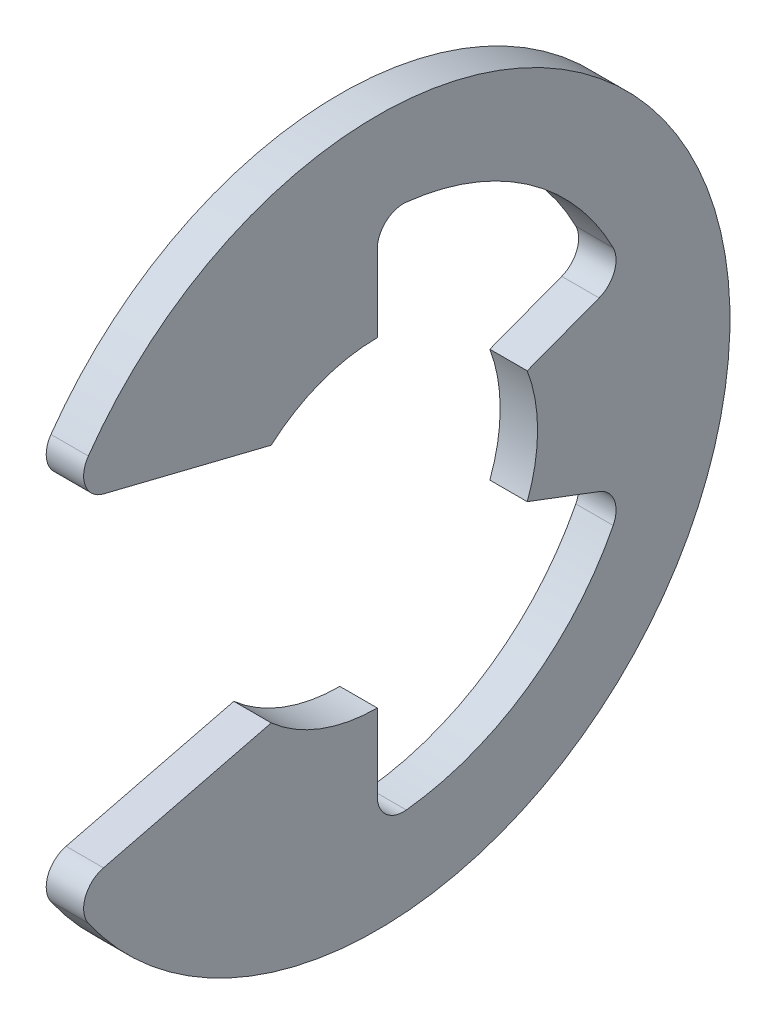
ISO-10303-21;
HEADER;
FILE_DESCRIPTION(('STEP AP214'),'2;1');
FILE_NAME('part.step','',(''),(''),'','','');
FILE_SCHEMA(('AUTOMOTIVE_DESIGN { 1 0 10303 214 1 1 1 1 }'));
ENDSEC;
DATA;
#1=APPLICATION_CONTEXT('core data for automotive mechanical design processes');
#2=APPLICATION_PROTOCOL_DEFINITION('international standard','automotive_design',2000,#1);
#3=PRODUCT_CONTEXT('',#1,'mechanical');
#4=PRODUCT('Part','Part','',(#3));
#5=PRODUCT_RELATED_PRODUCT_CATEGORY('part','',(#4));
#6=PRODUCT_DEFINITION_FORMATION('','',#4);
#7=PRODUCT_DEFINITION_CONTEXT('part definition',#1,'design');
#8=PRODUCT_DEFINITION('design','',#6,#7);
#9=PRODUCT_DEFINITION_SHAPE('','',#8);
#10=(LENGTH_UNIT() NAMED_UNIT(*) SI_UNIT(.MILLI.,.METRE.));
#11=(NAMED_UNIT(*) PLANE_ANGLE_UNIT() SI_UNIT($,.RADIAN.));
#12=(NAMED_UNIT(*) SI_UNIT($,.STERADIAN.) SOLID_ANGLE_UNIT());
#13=UNCERTAINTY_MEASURE_WITH_UNIT(LENGTH_MEASURE(1.E-05),#10,'distance_accuracy_value','');
#14=(GEOMETRIC_REPRESENTATION_CONTEXT(3) GLOBAL_UNCERTAINTY_ASSIGNED_CONTEXT((#13)) GLOBAL_UNIT_ASSIGNED_CONTEXT((#10,
#11,#12)) REPRESENTATION_CONTEXT('',''));
#15=CARTESIAN_POINT('',(0.,0.,0.));
#16=DIRECTION('',(0.,0.,1.));
#17=DIRECTION('',(1.,0.,0.));
#18=AXIS2_PLACEMENT_3D('',#15,#16,#17);
#19=CARTESIAN_POINT('',(0.4445,0.,0.));
#20=DIRECTION('',(-1.,0.,0.));
#21=DIRECTION('',(0.,0.,1.));
#22=AXIS2_PLACEMENT_3D('',#19,#20,#21);
#23=CYLINDRICAL_SURFACE('',#22,8.382);
#24=CARTESIAN_POINT('',(0.4445,0.,0.));
#25=DIRECTION('',(1.,0.,0.));
#26=DIRECTION('',(0.,0.,-1.));
#27=AXIS2_PLACEMENT_3D('',#24,#25,#26);
#28=CIRCLE('',#27,8.382);
#29=CARTESIAN_POINT('',(0.4445,-4.80802904314384,6.86591441253715));
#30=VERTEX_POINT('',#29);
#31=CARTESIAN_POINT('',(0.4445,4.80802904314383,6.86591441253715));
#32=VERTEX_POINT('',#31);
#33=EDGE_CURVE('E170',#30,#32,#28,.T.);
#34=ORIENTED_EDGE('',*,*,#33,.F.);
#35=DIRECTION('',(-1.,0.,0.));
#36=VECTOR('',#35,1.);
#37=CARTESIAN_POINT('',(0.4445,-4.80802904314384,6.86591441253715));
#38=LINE('',#37,#36);
#39=CARTESIAN_POINT('',(-0.4445,-4.80802904314384,6.86591441253715));
#40=VERTEX_POINT('',#39);
#41=EDGE_CURVE('E264',#30,#40,#38,.T.);
#42=ORIENTED_EDGE('',*,*,#41,.T.);
#43=CARTESIAN_POINT('',(-0.4445,0.,0.));
#44=DIRECTION('',(1.,0.,0.));
#45=DIRECTION('',(0.,0.,-1.));
#46=AXIS2_PLACEMENT_3D('',#43,#44,#45);
#47=CIRCLE('',#46,8.382);
#48=CARTESIAN_POINT('',(-0.4445,4.80802904314383,6.86591441253715));
#49=VERTEX_POINT('',#48);
#50=EDGE_CURVE('E208',#40,#49,#47,.T.);
#51=ORIENTED_EDGE('',*,*,#50,.T.);
#52=DIRECTION('',(-1.,0.,0.));
#53=VECTOR('',#52,1.);
#54=CARTESIAN_POINT('',(0.4445,4.80802904314383,6.86591441253715));
#55=LINE('',#54,#53);
#56=EDGE_CURVE('E262',#49,#32,#55,.F.);
#57=ORIENTED_EDGE('',*,*,#56,.T.);
#58=EDGE_LOOP('',(#34,#42,#51,#57));
#59=FACE_BOUND('',#58,.T.);
#60=ADVANCED_FACE('F32',(#59),#23,.T.);
#61=CARTESIAN_POINT('',(0.4445,4.05333224143882,7.33678551823021));
#62=DIRECTION('',(0.,0.970536829925373,-0.240952820606873));
#63=DIRECTION('',(0.,0.240952820606873,0.970536829925373));
#64=AXIS2_PLACEMENT_3D('',#61,#62,#63);
#65=PLANE('',#64);
#66=DIRECTION('',(0.,-0.240952820606873,-0.970536829925373));
#67=VECTOR('',#66,1.);
#68=CARTESIAN_POINT('',(0.4445,4.05333224143882,7.33678551823021));
#69=LINE('',#68,#67);
#70=CARTESIAN_POINT('',(0.4445,3.84710424189029,6.50611722217305));
#71=VERTEX_POINT('',#70);
#72=CARTESIAN_POINT('',(0.4445,2.8575,2.52007812378902));
#73=VERTEX_POINT('',#72);
#74=EDGE_CURVE('E156',#71,#73,#69,.T.);
#75=ORIENTED_EDGE('',*,*,#74,.F.);
#76=DIRECTION('',(-1.,0.,0.));
#77=VECTOR('',#76,1.);
#78=CARTESIAN_POINT('',(0.4445,3.84710424189029,6.50611722217305));
#79=LINE('',#78,#77);
#80=CARTESIAN_POINT('',(-0.4445,3.84710424189029,6.50611722217305));
#81=VERTEX_POINT('',#80);
#82=EDGE_CURVE('E276',#71,#81,#79,.T.);
#83=ORIENTED_EDGE('',*,*,#82,.T.);
#84=DIRECTION('',(0.,-0.240952820606873,-0.970536829925373));
#85=VECTOR('',#84,1.);
#86=CARTESIAN_POINT('',(-0.4445,4.05333224143882,7.33678551823021));
#87=LINE('',#86,#85);
#88=CARTESIAN_POINT('',(-0.4445,2.8575,2.52007812378902));
#89=VERTEX_POINT('',#88);
#90=EDGE_CURVE('E176',#81,#89,#87,.T.);
#91=ORIENTED_EDGE('',*,*,#90,.T.);
#92=DIRECTION('',(-1.,0.,0.));
#93=VECTOR('',#92,1.);
#94=CARTESIAN_POINT('',(0.4445,2.8575,2.52007812378902));
#95=LINE('',#94,#93);
#96=EDGE_CURVE('E173',#73,#89,#95,.T.);
#97=ORIENTED_EDGE('',*,*,#96,.F.);
#98=EDGE_LOOP('',(#75,#83,#91,#97));
#99=FACE_BOUND('',#98,.T.);
#100=ADVANCED_FACE('F174',(#99),#65,.F.);
#101=CARTESIAN_POINT('',(0.4445,0.,0.));
#102=DIRECTION('',(-1.,0.,0.));
#103=DIRECTION('',(0.,0.,1.));
#104=AXIS2_PLACEMENT_3D('',#101,#102,#103);
#105=CYLINDRICAL_SURFACE('',#104,3.81);
#106=CARTESIAN_POINT('',(-0.4445,0.,0.));
#107=DIRECTION('',(-1.,0.,0.));
#108=DIRECTION('',(0.,0.,1.));
#109=AXIS2_PLACEMENT_3D('',#106,#107,#108);
#110=CIRCLE('',#109,3.81);
#111=CARTESIAN_POINT('',(-0.4445,3.81,0.));
#112=VERTEX_POINT('',#111);
#113=EDGE_CURVE('E212',#89,#112,#110,.T.);
#114=ORIENTED_EDGE('',*,*,#113,.T.);
#115=DIRECTION('',(-1.,0.,0.));
#116=VECTOR('',#115,1.);
#117=CARTESIAN_POINT('',(0.4445,3.81,0.));
#118=LINE('',#117,#116);
#119=CARTESIAN_POINT('',(0.4445,3.81,0.));
#120=VERTEX_POINT('',#119);
#121=EDGE_CURVE('E180',#120,#112,#118,.T.);
#122=ORIENTED_EDGE('',*,*,#121,.F.);
#123=CARTESIAN_POINT('',(0.4445,0.,0.));
#124=DIRECTION('',(-1.,0.,0.));
#125=DIRECTION('',(0.,0.,1.));
#126=AXIS2_PLACEMENT_3D('',#123,#124,#125);
#127=CIRCLE('',#126,3.81);
#128=EDGE_CURVE('E162',#73,#120,#127,.T.);
#129=ORIENTED_EDGE('',*,*,#128,.F.);
#130=ORIENTED_EDGE('',*,*,#96,.T.);
#131=EDGE_LOOP('',(#114,#122,#129,#130));
#132=FACE_BOUND('',#131,.T.);
#133=ADVANCED_FACE('F182',(#132),#105,.F.);
#134=CARTESIAN_POINT('',(0.4445,3.81,0.));
#135=DIRECTION('',(0.,0.,1.));
#136=DIRECTION('',(0.,-1.,0.));
#137=AXIS2_PLACEMENT_3D('',#134,#135,#136);
#138=PLANE('',#137);
#139=DIRECTION('',(0.,1.,0.));
#140=VECTOR('',#139,1.);
#141=CARTESIAN_POINT('',(-0.4445,3.81,0.));
#142=LINE('',#141,#140);
#143=CARTESIAN_POINT('',(-0.4445,5.63609412254343,0.));
#144=VERTEX_POINT('',#143);
#145=EDGE_CURVE('E214',#112,#144,#142,.T.);
#146=ORIENTED_EDGE('',*,*,#145,.T.);
#147=DIRECTION('',(1.,0.,0.));
#148=VECTOR('',#147,1.);
#149=CARTESIAN_POINT('',(0.4445,5.63609412254343,0.));
#150=LINE('',#149,#148);
#151=CARTESIAN_POINT('',(0.4445,5.63609412254343,0.));
#152=VERTEX_POINT('',#151);
#153=EDGE_CURVE('E260',#144,#152,#150,.T.);
#154=ORIENTED_EDGE('',*,*,#153,.T.);
#155=DIRECTION('',(0.,1.,0.));
#156=VECTOR('',#155,1.);
#157=CARTESIAN_POINT('',(0.4445,3.81,0.));
#158=LINE('',#157,#156);
#159=EDGE_CURVE('E185',#120,#152,#158,.T.);
#160=ORIENTED_EDGE('',*,*,#159,.F.);
#161=ORIENTED_EDGE('',*,*,#121,.T.);
#162=EDGE_LOOP('',(#146,#154,#160,#161));
#163=FACE_BOUND('',#162,.T.);
#164=ADVANCED_FACE('F382',(#163),#138,.F.);
#165=CARTESIAN_POINT('',(0.4445,0.,0.));
#166=DIRECTION('',(-1.,0.,0.));
#167=DIRECTION('',(0.,0.,1.));
#168=AXIS2_PLACEMENT_3D('',#165,#166,#167);
#169=CYLINDRICAL_SURFACE('',#168,6.29264516129032);
#170=CARTESIAN_POINT('',(0.4445,0.,0.));
#171=DIRECTION('',(-1.,0.,0.));
#172=DIRECTION('',(0.,0.,-1.));
#173=AXIS2_PLACEMENT_3D('',#170,#171,#172);
#174=CIRCLE('',#173,6.29264516129032);
#175=CARTESIAN_POINT('',(0.4445,6.25463519415267,-0.690595188208944));
#176=VERTEX_POINT('',#175);
#177=CARTESIAN_POINT('',(0.4445,2.85734012662483,-5.60651322362572));
#178=VERTEX_POINT('',#177);
#179=EDGE_CURVE('E187',#176,#178,#174,.T.);
#180=ORIENTED_EDGE('',*,*,#179,.F.);
#181=DIRECTION('',(-1.,0.,0.));
#182=VECTOR('',#181,1.);
#183=CARTESIAN_POINT('',(0.4445,6.25463519415267,-0.690595188208944));
#184=LINE('',#183,#182);
#185=CARTESIAN_POINT('',(-0.4445,6.25463519415267,-0.690595188208944));
#186=VERTEX_POINT('',#185);
#187=EDGE_CURVE('E257',#176,#186,#184,.T.);
#188=ORIENTED_EDGE('',*,*,#187,.T.);
#189=CARTESIAN_POINT('',(-0.4445,0.,0.));
#190=DIRECTION('',(-1.,0.,0.));
#191=DIRECTION('',(0.,0.,-1.));
#192=AXIS2_PLACEMENT_3D('',#189,#190,#191);
#193=CIRCLE('',#192,6.29264516129032);
#194=CARTESIAN_POINT('',(-0.4445,2.85734012662483,-5.60651322362572));
#195=VERTEX_POINT('',#194);
#196=EDGE_CURVE('E217',#186,#195,#193,.T.);
#197=ORIENTED_EDGE('',*,*,#196,.T.);
#198=DIRECTION('',(-1.,0.,0.));
#199=VECTOR('',#198,1.);
#200=CARTESIAN_POINT('',(0.4445,2.85734012662483,-5.60651322362572));
#201=LINE('',#200,#199);
#202=EDGE_CURVE('E255',#195,#178,#201,.F.);
#203=ORIENTED_EDGE('',*,*,#202,.T.);
#204=EDGE_LOOP('',(#180,#188,#197,#203));
#205=FACE_BOUND('',#204,.T.);
#206=ADVANCED_FACE('F304',(#205),#169,.F.);
#207=CARTESIAN_POINT('',(0.4445,1.34703841816037,-3.56392866090218));
#208=DIRECTION('',(0.,-0.935414346693485,-0.353553390593274));
#209=DIRECTION('',(0.,0.353553390593274,-0.935414346693485));
#210=AXIS2_PLACEMENT_3D('',#207,#208,#209);
#211=PLANE('',#210);
#212=DIRECTION('',(0.,-0.353553390593274,0.935414346693485));
#213=VECTOR('',#212,1.);
#214=CARTESIAN_POINT('',(0.4445,1.34703841816037,-3.56392866090218));
#215=LINE('',#214,#213);
#216=CARTESIAN_POINT('',(0.4445,1.99266018672805,-5.27208330154195));
#217=VERTEX_POINT('',#216);
#218=CARTESIAN_POINT('',(0.4445,1.34703841816037,-3.56392866090218));
#219=VERTEX_POINT('',#218);
#220=EDGE_CURVE('E192',#217,#219,#215,.T.);
#221=ORIENTED_EDGE('',*,*,#220,.F.);
#222=DIRECTION('',(1.,0.,0.));
#223=VECTOR('',#222,1.);
#224=CARTESIAN_POINT('',(-0.4445,1.99266018672805,-5.27208330154195));
#225=LINE('',#224,#223);
#226=CARTESIAN_POINT('',(-0.4445,1.99266018672805,-5.27208330154195));
#227=VERTEX_POINT('',#226);
#228=EDGE_CURVE('E279',#217,#227,#225,.F.);
#229=ORIENTED_EDGE('',*,*,#228,.T.);
#230=DIRECTION('',(0.,-0.353553390593274,0.935414346693485));
#231=VECTOR('',#230,1.);
#232=CARTESIAN_POINT('',(-0.4445,1.34703841816037,-3.56392866090218));
#233=LINE('',#232,#231);
#234=CARTESIAN_POINT('',(-0.4445,1.34703841816037,-3.56392866090218));
#235=VERTEX_POINT('',#234);
#236=EDGE_CURVE('E220',#227,#235,#233,.T.);
#237=ORIENTED_EDGE('',*,*,#236,.T.);
#238=DIRECTION('',(-1.,0.,0.));
#239=VECTOR('',#238,1.);
#240=CARTESIAN_POINT('',(0.4445,1.34703841816037,-3.56392866090218));
#241=LINE('',#240,#239);
#242=EDGE_CURVE('E244',#219,#235,#241,.T.);
#243=ORIENTED_EDGE('',*,*,#242,.F.);
#244=EDGE_LOOP('',(#221,#229,#237,#243));
#245=FACE_BOUND('',#244,.T.);
#246=ADVANCED_FACE('F307',(#245),#211,.F.);
#247=CARTESIAN_POINT('',(0.4445,0.,0.));
#248=DIRECTION('',(-1.,0.,0.));
#249=DIRECTION('',(0.,0.,1.));
#250=AXIS2_PLACEMENT_3D('',#247,#248,#249);
#251=CYLINDRICAL_SURFACE('',#250,3.81);
#252=CARTESIAN_POINT('',(-0.4445,0.,0.));
#253=DIRECTION('',(-1.,0.,0.));
#254=DIRECTION('',(0.,0.,1.));
#255=AXIS2_PLACEMENT_3D('',#252,#253,#254);
#256=CIRCLE('',#255,3.81);
#257=CARTESIAN_POINT('',(-0.4445,-1.34703841816037,-3.56392866090218));
#258=VERTEX_POINT('',#257);
#259=EDGE_CURVE('E222',#235,#258,#256,.T.);
#260=ORIENTED_EDGE('',*,*,#259,.T.);
#261=DIRECTION('',(-1.,0.,0.));
#262=VECTOR('',#261,1.);
#263=CARTESIAN_POINT('',(0.4445,-1.34703841816037,-3.56392866090218));
#264=LINE('',#263,#262);
#265=CARTESIAN_POINT('',(0.4445,-1.34703841816037,-3.56392866090218));
#266=VERTEX_POINT('',#265);
#267=EDGE_CURVE('E241',#266,#258,#264,.T.);
#268=ORIENTED_EDGE('',*,*,#267,.F.);
#269=CARTESIAN_POINT('',(0.4445,0.,0.));
#270=DIRECTION('',(-1.,0.,0.));
#271=DIRECTION('',(0.,0.,1.));
#272=AXIS2_PLACEMENT_3D('',#269,#270,#271);
#273=CIRCLE('',#272,3.81);
#274=EDGE_CURVE('E194',#219,#266,#273,.T.);
#275=ORIENTED_EDGE('',*,*,#274,.F.);
#276=ORIENTED_EDGE('',*,*,#242,.T.);
#277=EDGE_LOOP('',(#260,#268,#275,#276));
#278=FACE_BOUND('',#277,.T.);
#279=ADVANCED_FACE('F313',(#278),#251,.F.);
#280=CARTESIAN_POINT('',(0.4445,-1.34703841816037,-3.56392866090218));
#281=DIRECTION('',(0.,0.935414346693485,-0.353553390593274));
#282=DIRECTION('',(0.,0.353553390593274,0.935414346693485));
#283=AXIS2_PLACEMENT_3D('',#280,#281,#282);
#284=PLANE('',#283);
#285=DIRECTION('',(0.,-0.353553390593274,-0.935414346693485));
#286=VECTOR('',#285,1.);
#287=CARTESIAN_POINT('',(-0.4445,-1.34703841816037,-3.56392866090218));
#288=LINE('',#287,#286);
#289=CARTESIAN_POINT('',(-0.4445,-1.99266018672805,-5.27208330154195));
#290=VERTEX_POINT('',#289);
#291=EDGE_CURVE('E224',#258,#290,#288,.T.);
#292=ORIENTED_EDGE('',*,*,#291,.T.);
#293=DIRECTION('',(1.,0.,0.));
#294=VECTOR('',#293,1.);
#295=CARTESIAN_POINT('',(0.4445,-1.99266018672805,-5.27208330154195));
#296=LINE('',#295,#294);
#297=CARTESIAN_POINT('',(0.4445,-1.99266018672805,-5.27208330154195));
#298=VERTEX_POINT('',#297);
#299=EDGE_CURVE('E47',#290,#298,#296,.T.);
#300=ORIENTED_EDGE('',*,*,#299,.T.);
#301=DIRECTION('',(0.,-0.353553390593274,-0.935414346693485));
#302=VECTOR('',#301,1.);
#303=CARTESIAN_POINT('',(0.4445,-1.34703841816037,-3.56392866090218));
#304=LINE('',#303,#302);
#305=EDGE_CURVE('E196',#266,#298,#304,.T.);
#306=ORIENTED_EDGE('',*,*,#305,.F.);
#307=ORIENTED_EDGE('',*,*,#267,.T.);
#308=EDGE_LOOP('',(#292,#300,#306,#307));
#309=FACE_BOUND('',#308,.T.);
#310=ADVANCED_FACE('F315',(#309),#284,.F.);
#311=CARTESIAN_POINT('',(0.4445,0.,0.));
#312=DIRECTION('',(-1.,0.,0.));
#313=DIRECTION('',(0.,0.,1.));
#314=AXIS2_PLACEMENT_3D('',#311,#312,#313);
#315=CYLINDRICAL_SURFACE('',#314,6.29264516129032);
#316=CARTESIAN_POINT('',(-0.4445,0.,0.));
#317=DIRECTION('',(-1.,0.,0.));
#318=DIRECTION('',(0.,0.,-1.));
#319=AXIS2_PLACEMENT_3D('',#316,#317,#318);
#320=CIRCLE('',#319,6.29264516129032);
#321=CARTESIAN_POINT('',(-0.4445,-2.85734012662483,-5.60651322362573));
#322=VERTEX_POINT('',#321);
#323=CARTESIAN_POINT('',(-0.4445,-6.25463519415267,-0.690595188208945));
#324=VERTEX_POINT('',#323);
#325=EDGE_CURVE('E226',#322,#324,#320,.T.);
#326=ORIENTED_EDGE('',*,*,#325,.T.);
#327=DIRECTION('',(-1.,0.,0.));
#328=VECTOR('',#327,1.);
#329=CARTESIAN_POINT('',(0.4445,-6.25463519415267,-0.690595188208945));
#330=LINE('',#329,#328);
#331=CARTESIAN_POINT('',(0.4445,-6.25463519415267,-0.690595188208945));
#332=VERTEX_POINT('',#331);
#333=EDGE_CURVE('E253',#324,#332,#330,.F.);
#334=ORIENTED_EDGE('',*,*,#333,.T.);
#335=CARTESIAN_POINT('',(0.4445,0.,0.));
#336=DIRECTION('',(-1.,0.,0.));
#337=DIRECTION('',(0.,0.,-1.));
#338=AXIS2_PLACEMENT_3D('',#335,#336,#337);
#339=CIRCLE('',#338,6.29264516129032);
#340=CARTESIAN_POINT('',(0.4445,-2.85734012662483,-5.60651322362573));
#341=VERTEX_POINT('',#340);
#342=EDGE_CURVE('E198',#341,#332,#339,.T.);
#343=ORIENTED_EDGE('',*,*,#342,.F.);
#344=DIRECTION('',(-1.,0.,0.));
#345=VECTOR('',#344,1.);
#346=CARTESIAN_POINT('',(0.4445,-2.85734012662483,-5.60651322362573));
#347=LINE('',#346,#345);
#348=EDGE_CURVE('E250',#341,#322,#347,.T.);
#349=ORIENTED_EDGE('',*,*,#348,.T.);
#350=EDGE_LOOP('',(#326,#334,#343,#349));
#351=FACE_BOUND('',#350,.T.);
#352=ADVANCED_FACE('F317',(#351),#315,.F.);
#353=CARTESIAN_POINT('',(0.4445,-3.81,0.));
#354=DIRECTION('',(0.,0.,1.));
#355=DIRECTION('',(0.,-1.,0.));
#356=AXIS2_PLACEMENT_3D('',#353,#354,#355);
#357=PLANE('',#356);
#358=DIRECTION('',(0.,1.,0.));
#359=VECTOR('',#358,1.);
#360=CARTESIAN_POINT('',(0.4445,-3.81,0.));
#361=LINE('',#360,#359);
#362=CARTESIAN_POINT('',(0.4445,-5.63609412254343,0.));
#363=VERTEX_POINT('',#362);
#364=CARTESIAN_POINT('',(0.4445,-3.81,0.));
#365=VERTEX_POINT('',#364);
#366=EDGE_CURVE('E201',#363,#365,#361,.T.);
#367=ORIENTED_EDGE('',*,*,#366,.F.);
#368=DIRECTION('',(1.,0.,0.));
#369=VECTOR('',#368,1.);
#370=CARTESIAN_POINT('',(-0.4445,-5.63609412254343,0.));
#371=LINE('',#370,#369);
#372=CARTESIAN_POINT('',(-0.4445,-5.63609412254343,0.));
#373=VERTEX_POINT('',#372);
#374=EDGE_CURVE('E179',#363,#373,#371,.F.);
#375=ORIENTED_EDGE('',*,*,#374,.T.);
#376=DIRECTION('',(0.,1.,0.));
#377=VECTOR('',#376,1.);
#378=CARTESIAN_POINT('',(-0.4445,-3.81,0.));
#379=LINE('',#378,#377);
#380=CARTESIAN_POINT('',(-0.4445,-3.81,0.));
#381=VERTEX_POINT('',#380);
#382=EDGE_CURVE('E229',#373,#381,#379,.T.);
#383=ORIENTED_EDGE('',*,*,#382,.T.);
#384=DIRECTION('',(-1.,0.,0.));
#385=VECTOR('',#384,1.);
#386=CARTESIAN_POINT('',(0.4445,-3.81,0.));
#387=LINE('',#386,#385);
#388=EDGE_CURVE('E238',#365,#381,#387,.T.);
#389=ORIENTED_EDGE('',*,*,#388,.F.);
#390=EDGE_LOOP('',(#367,#375,#383,#389));
#391=FACE_BOUND('',#390,.T.);
#392=ADVANCED_FACE('F323',(#391),#357,.F.);
#393=CARTESIAN_POINT('',(0.4445,0.,0.));
#394=DIRECTION('',(-1.,0.,0.));
#395=DIRECTION('',(0.,0.,1.));
#396=AXIS2_PLACEMENT_3D('',#393,#394,#395);
#397=CYLINDRICAL_SURFACE('',#396,3.81);
#398=CARTESIAN_POINT('',(-0.4445,0.,0.));
#399=DIRECTION('',(-1.,0.,0.));
#400=DIRECTION('',(0.,0.,-1.));
#401=AXIS2_PLACEMENT_3D('',#398,#399,#400);
#402=CIRCLE('',#401,3.81);
#403=CARTESIAN_POINT('',(-0.4445,-2.8575,2.52007812378902));
#404=VERTEX_POINT('',#403);
#405=EDGE_CURVE('E231',#381,#404,#402,.T.);
#406=ORIENTED_EDGE('',*,*,#405,.T.);
#407=DIRECTION('',(-1.,0.,0.));
#408=VECTOR('',#407,1.);
#409=CARTESIAN_POINT('',(0.4445,-2.8575,2.52007812378902));
#410=LINE('',#409,#408);
#411=CARTESIAN_POINT('',(0.4445,-2.8575,2.52007812378902));
#412=VERTEX_POINT('',#411);
#413=EDGE_CURVE('E207',#412,#404,#410,.T.);
#414=ORIENTED_EDGE('',*,*,#413,.F.);
#415=CARTESIAN_POINT('',(0.4445,0.,0.));
#416=DIRECTION('',(-1.,0.,0.));
#417=DIRECTION('',(0.,0.,-1.));
#418=AXIS2_PLACEMENT_3D('',#415,#416,#417);
#419=CIRCLE('',#418,3.81);
#420=EDGE_CURVE('E203',#365,#412,#419,.T.);
#421=ORIENTED_EDGE('',*,*,#420,.F.);
#422=ORIENTED_EDGE('',*,*,#388,.T.);
#423=EDGE_LOOP('',(#406,#414,#421,#422));
#424=FACE_BOUND('',#423,.T.);
#425=ADVANCED_FACE('F372',(#424),#397,.F.);
#426=CARTESIAN_POINT('',(0.4445,-4.05333224143882,7.33678551823021));
#427=DIRECTION('',(0.,-0.970536829925373,-0.240952820606873));
#428=DIRECTION('',(0.,0.240952820606873,-0.970536829925373));
#429=AXIS2_PLACEMENT_3D('',#426,#427,#428);
#430=PLANE('',#429);
#431=DIRECTION('',(0.,-0.240952820606873,0.970536829925373));
#432=VECTOR('',#431,1.);
#433=CARTESIAN_POINT('',(-0.4445,-4.05333224143882,7.33678551823021));
#434=LINE('',#433,#432);
#435=CARTESIAN_POINT('',(-0.4445,-3.84710424189029,6.50611722217305));
#436=VERTEX_POINT('',#435);
#437=EDGE_CURVE('E233',#404,#436,#434,.T.);
#438=ORIENTED_EDGE('',*,*,#437,.T.);
#439=DIRECTION('',(-1.,0.,0.));
#440=VECTOR('',#439,1.);
#441=CARTESIAN_POINT('',(0.4445,-3.84710424189029,6.50611722217305));
#442=LINE('',#441,#440);
#443=CARTESIAN_POINT('',(0.4445,-3.84710424189029,6.50611722217305));
#444=VERTEX_POINT('',#443);
#445=EDGE_CURVE('E271',#436,#444,#442,.F.);
#446=ORIENTED_EDGE('',*,*,#445,.T.);
#447=DIRECTION('',(0.,-0.240952820606873,0.970536829925373));
#448=VECTOR('',#447,1.);
#449=CARTESIAN_POINT('',(0.4445,-4.05333224143882,7.33678551823021));
#450=LINE('',#449,#448);
#451=EDGE_CURVE('E205',#412,#444,#450,.T.);
#452=ORIENTED_EDGE('',*,*,#451,.F.);
#453=ORIENTED_EDGE('',*,*,#413,.T.);
#454=EDGE_LOOP('',(#438,#446,#452,#453));
#455=FACE_BOUND('',#454,.T.);
#456=ADVANCED_FACE('F414',(#455),#430,.F.);
#457=CARTESIAN_POINT('',(0.4445,0.,0.));
#458=DIRECTION('',(1.,0.,0.));
#459=DIRECTION('',(0.,0.,-1.));
#460=AXIS2_PLACEMENT_3D('',#457,#458,#459);
#461=PLANE('',#460);
#462=ORIENTED_EDGE('',*,*,#451,.T.);
#463=CARTESIAN_POINT('',(0.4445,-4.45106931115285,6.35617228190939));
#464=DIRECTION('',(1.,0.,0.));
#465=DIRECTION('',(0.,0.,-1.));
#466=AXIS2_PLACEMENT_3D('',#463,#464,#465);
#467=CIRCLE('',#466,0.6223);
#468=EDGE_CURVE('E274',#444,#30,#467,.T.);
#469=ORIENTED_EDGE('',*,*,#468,.T.);
#470=ORIENTED_EDGE('',*,*,#33,.T.);
#471=CARTESIAN_POINT('',(0.4445,4.45106931115285,6.35617228190939));
#472=DIRECTION('',(1.,0.,0.));
#473=DIRECTION('',(0.,0.,-1.));
#474=AXIS2_PLACEMENT_3D('',#471,#472,#473);
#475=CIRCLE('',#474,0.6223);
#476=EDGE_CURVE('E166',#32,#71,#475,.T.);
#477=ORIENTED_EDGE('',*,*,#476,.T.);
#478=ORIENTED_EDGE('',*,*,#74,.T.);
#479=ORIENTED_EDGE('',*,*,#128,.T.);
#480=ORIENTED_EDGE('',*,*,#159,.T.);
#481=CARTESIAN_POINT('',(0.4445,5.63609412254343,-0.622299999999999));
#482=DIRECTION('',(1.,0.,0.));
#483=DIRECTION('',(0.,0.,-1.));
#484=AXIS2_PLACEMENT_3D('',#481,#482,#483);
#485=CIRCLE('',#484,0.6223);
#486=EDGE_CURVE('E288',#152,#176,#485,.F.);
#487=ORIENTED_EDGE('',*,*,#486,.T.);
#488=ORIENTED_EDGE('',*,*,#179,.T.);
#489=CARTESIAN_POINT('',(0.4445,2.57476853467541,-5.05206702657576));
#490=DIRECTION('',(1.,0.,0.));
#491=DIRECTION('',(0.,0.,-1.));
#492=AXIS2_PLACEMENT_3D('',#489,#490,#491);
#493=CIRCLE('',#492,0.6223);
#494=EDGE_CURVE('E11',#178,#217,#493,.F.);
#495=ORIENTED_EDGE('',*,*,#494,.T.);
#496=ORIENTED_EDGE('',*,*,#220,.T.);
#497=ORIENTED_EDGE('',*,*,#274,.T.);
#498=ORIENTED_EDGE('',*,*,#305,.T.);
#499=CARTESIAN_POINT('',(0.4445,-2.57476853467541,-5.05206702657576));
#500=DIRECTION('',(1.,0.,0.));
#501=DIRECTION('',(0.,0.,-1.));
#502=AXIS2_PLACEMENT_3D('',#499,#500,#501);
#503=CIRCLE('',#502,0.6223);
#504=EDGE_CURVE('E292',#298,#341,#503,.F.);
#505=ORIENTED_EDGE('',*,*,#504,.T.);
#506=ORIENTED_EDGE('',*,*,#342,.T.);
#507=CARTESIAN_POINT('',(0.4445,-5.63609412254343,-0.622300000000001));
#508=DIRECTION('',(1.,0.,0.));
#509=DIRECTION('',(0.,0.,-1.));
#510=AXIS2_PLACEMENT_3D('',#507,#508,#509);
#511=CIRCLE('',#510,0.6223);
#512=EDGE_CURVE('E284',#332,#363,#511,.F.);
#513=ORIENTED_EDGE('',*,*,#512,.T.);
#514=ORIENTED_EDGE('',*,*,#366,.T.);
#515=ORIENTED_EDGE('',*,*,#420,.T.);
#516=EDGE_LOOP('',(#462,#469,#470,#477,#478,#479,#480,#487,#488,#495,#496,#497,#498,#505,#506,
#513,#514,#515));
#517=FACE_BOUND('',#516,.T.);
#518=ADVANCED_FACE('F159',(#517),#461,.T.);
#519=CARTESIAN_POINT('',(-0.4445,0.,0.));
#520=DIRECTION('',(1.,0.,0.));
#521=DIRECTION('',(0.,0.,-1.));
#522=AXIS2_PLACEMENT_3D('',#519,#520,#521);
#523=PLANE('',#522);
#524=ORIENTED_EDGE('',*,*,#50,.F.);
#525=CARTESIAN_POINT('',(-0.4445,-4.45106931115285,6.35617228190939));
#526=DIRECTION('',(1.,0.,0.));
#527=DIRECTION('',(0.,0.,-1.));
#528=AXIS2_PLACEMENT_3D('',#525,#526,#527);
#529=CIRCLE('',#528,0.6223);
#530=EDGE_CURVE('E269',#40,#436,#529,.F.);
#531=ORIENTED_EDGE('',*,*,#530,.T.);
#532=ORIENTED_EDGE('',*,*,#437,.F.);
#533=ORIENTED_EDGE('',*,*,#405,.F.);
#534=ORIENTED_EDGE('',*,*,#382,.F.);
#535=CARTESIAN_POINT('',(-0.4445,-5.63609412254343,-0.622300000000001));
#536=DIRECTION('',(1.,0.,0.));
#537=DIRECTION('',(0.,0.,-1.));
#538=AXIS2_PLACEMENT_3D('',#535,#536,#537);
#539=CIRCLE('',#538,0.6223);
#540=EDGE_CURVE('E282',#373,#324,#539,.T.);
#541=ORIENTED_EDGE('',*,*,#540,.T.);
#542=ORIENTED_EDGE('',*,*,#325,.F.);
#543=CARTESIAN_POINT('',(-0.4445,-2.57476853467541,-5.05206702657576));
#544=DIRECTION('',(1.,0.,0.));
#545=DIRECTION('',(0.,0.,-1.));
#546=AXIS2_PLACEMENT_3D('',#543,#544,#545);
#547=CIRCLE('',#546,0.6223);
#548=EDGE_CURVE('E290',#322,#290,#547,.T.);
#549=ORIENTED_EDGE('',*,*,#548,.T.);
#550=ORIENTED_EDGE('',*,*,#291,.F.);
#551=ORIENTED_EDGE('',*,*,#259,.F.);
#552=ORIENTED_EDGE('',*,*,#236,.F.);
#553=CARTESIAN_POINT('',(-0.4445,2.57476853467541,-5.05206702657576));
#554=DIRECTION('',(1.,0.,0.));
#555=DIRECTION('',(0.,0.,-1.));
#556=AXIS2_PLACEMENT_3D('',#553,#554,#555);
#557=CIRCLE('',#556,0.6223);
#558=EDGE_CURVE('E40',#227,#195,#557,.T.);
#559=ORIENTED_EDGE('',*,*,#558,.T.);
#560=ORIENTED_EDGE('',*,*,#196,.F.);
#561=CARTESIAN_POINT('',(-0.4445,5.63609412254343,-0.622299999999999));
#562=DIRECTION('',(1.,0.,0.));
#563=DIRECTION('',(0.,0.,-1.));
#564=AXIS2_PLACEMENT_3D('',#561,#562,#563);
#565=CIRCLE('',#564,0.6223);
#566=EDGE_CURVE('E286',#186,#144,#565,.T.);
#567=ORIENTED_EDGE('',*,*,#566,.T.);
#568=ORIENTED_EDGE('',*,*,#145,.F.);
#569=ORIENTED_EDGE('',*,*,#113,.F.);
#570=ORIENTED_EDGE('',*,*,#90,.F.);
#571=CARTESIAN_POINT('',(-0.4445,4.45106931115285,6.35617228190939));
#572=DIRECTION('',(1.,0.,0.));
#573=DIRECTION('',(0.,0.,-1.));
#574=AXIS2_PLACEMENT_3D('',#571,#572,#573);
#575=CIRCLE('',#574,0.6223);
#576=EDGE_CURVE('E267',#81,#49,#575,.F.);
#577=ORIENTED_EDGE('',*,*,#576,.T.);
#578=EDGE_LOOP('',(#524,#531,#532,#533,#534,#541,#542,#549,#550,#551,#552,#559,#560,#567,#568,
#569,#570,#577));
#579=FACE_BOUND('',#578,.T.);
#580=ADVANCED_FACE('F297',(#579),#523,.F.);
#581=CARTESIAN_POINT('',(0.4445,-5.63609412254343,-0.622300000000001));
#582=DIRECTION('',(-1.,0.,0.));
#583=DIRECTION('',(0.,0.,1.));
#584=AXIS2_PLACEMENT_3D('',#581,#582,#583);
#585=CYLINDRICAL_SURFACE('',#584,0.6223);
#586=ORIENTED_EDGE('',*,*,#512,.F.);
#587=ORIENTED_EDGE('',*,*,#333,.F.);
#588=ORIENTED_EDGE('',*,*,#540,.F.);
#589=ORIENTED_EDGE('',*,*,#374,.F.);
#590=EDGE_LOOP('',(#586,#587,#588,#589));
#591=FACE_BOUND('',#590,.T.);
#592=ADVANCED_FACE('F337',(#591),#585,.F.);
#593=CARTESIAN_POINT('',(0.4445,5.63609412254343,-0.622299999999999));
#594=DIRECTION('',(-1.,0.,0.));
#595=DIRECTION('',(0.,0.,1.));
#596=AXIS2_PLACEMENT_3D('',#593,#594,#595);
#597=CYLINDRICAL_SURFACE('',#596,0.6223);
#598=ORIENTED_EDGE('',*,*,#486,.F.);
#599=ORIENTED_EDGE('',*,*,#153,.F.);
#600=ORIENTED_EDGE('',*,*,#566,.F.);
#601=ORIENTED_EDGE('',*,*,#187,.F.);
#602=EDGE_LOOP('',(#598,#599,#600,#601));
#603=FACE_BOUND('',#602,.T.);
#604=ADVANCED_FACE('F340',(#603),#597,.F.);
#605=CARTESIAN_POINT('',(0.4445,-4.45106931115285,6.35617228190939));
#606=DIRECTION('',(-1.,0.,0.));
#607=DIRECTION('',(0.,0.,1.));
#608=AXIS2_PLACEMENT_3D('',#605,#606,#607);
#609=CYLINDRICAL_SURFACE('',#608,0.6223);
#610=ORIENTED_EDGE('',*,*,#468,.F.);
#611=ORIENTED_EDGE('',*,*,#445,.F.);
#612=ORIENTED_EDGE('',*,*,#530,.F.);
#613=ORIENTED_EDGE('',*,*,#41,.F.);
#614=EDGE_LOOP('',(#610,#611,#612,#613));
#615=FACE_BOUND('',#614,.T.);
#616=ADVANCED_FACE('F344',(#615),#609,.T.);
#617=CARTESIAN_POINT('',(0.4445,4.45106931115285,6.35617228190939));
#618=DIRECTION('',(-1.,0.,0.));
#619=DIRECTION('',(0.,0.,1.));
#620=AXIS2_PLACEMENT_3D('',#617,#618,#619);
#621=CYLINDRICAL_SURFACE('',#620,0.6223);
#622=ORIENTED_EDGE('',*,*,#476,.F.);
#623=ORIENTED_EDGE('',*,*,#56,.F.);
#624=ORIENTED_EDGE('',*,*,#576,.F.);
#625=ORIENTED_EDGE('',*,*,#82,.F.);
#626=EDGE_LOOP('',(#622,#623,#624,#625));
#627=FACE_BOUND('',#626,.T.);
#628=ADVANCED_FACE('F348',(#627),#621,.T.);
#629=CARTESIAN_POINT('',(0.4445,-2.57476853467541,-5.05206702657576));
#630=DIRECTION('',(-1.,0.,0.));
#631=DIRECTION('',(0.,0.,1.));
#632=AXIS2_PLACEMENT_3D('',#629,#630,#631);
#633=CYLINDRICAL_SURFACE('',#632,0.6223);
#634=ORIENTED_EDGE('',*,*,#504,.F.);
#635=ORIENTED_EDGE('',*,*,#299,.F.);
#636=ORIENTED_EDGE('',*,*,#548,.F.);
#637=ORIENTED_EDGE('',*,*,#348,.F.);
#638=EDGE_LOOP('',(#634,#635,#636,#637));
#639=FACE_BOUND('',#638,.T.);
#640=ADVANCED_FACE('F351',(#639),#633,.F.);
#641=CARTESIAN_POINT('',(0.4445,2.57476853467541,-5.05206702657576));
#642=DIRECTION('',(-1.,0.,0.));
#643=DIRECTION('',(0.,0.,1.));
#644=AXIS2_PLACEMENT_3D('',#641,#642,#643);
#645=CYLINDRICAL_SURFACE('',#644,0.6223);
#646=ORIENTED_EDGE('',*,*,#494,.F.);
#647=ORIENTED_EDGE('',*,*,#202,.F.);
#648=ORIENTED_EDGE('',*,*,#558,.F.);
#649=ORIENTED_EDGE('',*,*,#228,.F.);
#650=EDGE_LOOP('',(#646,#647,#648,#649));
#651=FACE_BOUND('',#650,.T.);
#652=ADVANCED_FACE('F34',(#651),#645,.F.);
#653=CLOSED_SHELL('',(#60,#100,#133,#164,#206,#246,#279,#310,#352,#392,#425,#456,#518,#580,#592,
#604,#616,#628,#640,#652));
#654=MANIFOLD_SOLID_BREP('B2',#653);
#655=ADVANCED_BREP_SHAPE_REPRESENTATION('',(#18,#654),#14);
#656=SHAPE_DEFINITION_REPRESENTATION(#9,#655);
ENDSEC;
END-ISO-10303-21;
